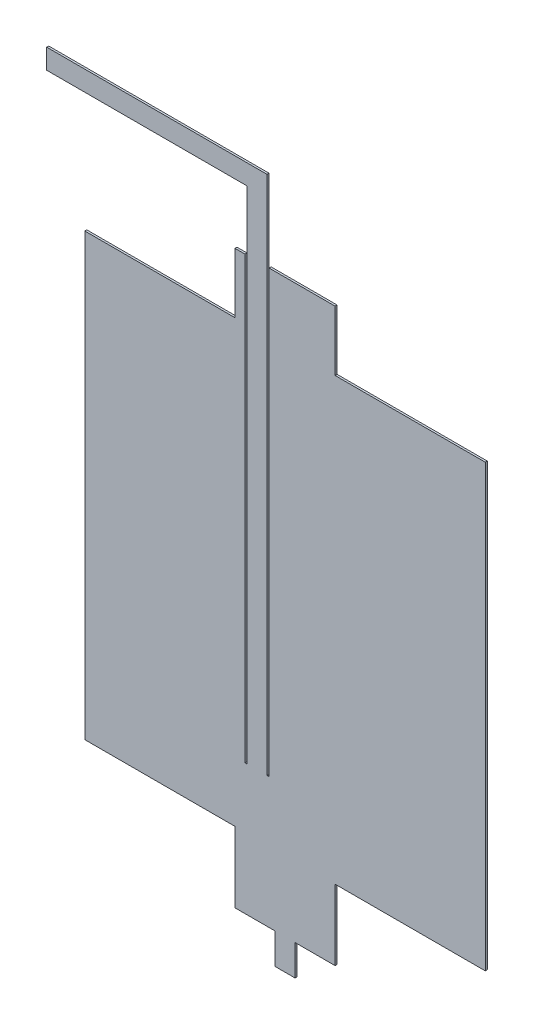
ISO-10303-21;
HEADER;
FILE_DESCRIPTION(('STEP AP214'),'2;1');
FILE_NAME('part.step','',(''),(''),'','','');
FILE_SCHEMA(('AUTOMOTIVE_DESIGN { 1 0 10303 214 1 1 1 1 }'));
ENDSEC;
DATA;
#1=APPLICATION_CONTEXT('core data for automotive mechanical design processes');
#2=APPLICATION_PROTOCOL_DEFINITION('international standard','automotive_design',2000,#1);
#3=PRODUCT_CONTEXT('',#1,'mechanical');
#4=PRODUCT('Part','Part','',(#3));
#5=PRODUCT_RELATED_PRODUCT_CATEGORY('part','',(#4));
#6=PRODUCT_DEFINITION_FORMATION('','',#4);
#7=PRODUCT_DEFINITION_CONTEXT('part definition',#1,'design');
#8=PRODUCT_DEFINITION('design','',#6,#7);
#9=PRODUCT_DEFINITION_SHAPE('','',#8);
#10=(LENGTH_UNIT() NAMED_UNIT(*) SI_UNIT(.MILLI.,.METRE.));
#11=(NAMED_UNIT(*) PLANE_ANGLE_UNIT() SI_UNIT($,.RADIAN.));
#12=(NAMED_UNIT(*) SI_UNIT($,.STERADIAN.) SOLID_ANGLE_UNIT());
#13=UNCERTAINTY_MEASURE_WITH_UNIT(LENGTH_MEASURE(1.E-05),#10,'distance_accuracy_value','');
#14=(GEOMETRIC_REPRESENTATION_CONTEXT(3) GLOBAL_UNCERTAINTY_ASSIGNED_CONTEXT((#13)) GLOBAL_UNIT_ASSIGNED_CONTEXT((#10,
#11,#12)) REPRESENTATION_CONTEXT('',''));
#15=CARTESIAN_POINT('',(0.,0.,0.));
#16=DIRECTION('',(0.,0.,1.));
#17=DIRECTION('',(1.,0.,0.));
#18=AXIS2_PLACEMENT_3D('',#15,#16,#17);
#19=CARTESIAN_POINT('',(0.,-20.,1.));
#20=DIRECTION('',(0.,1.,0.));
#21=DIRECTION('',(0.,0.,1.));
#22=AXIS2_PLACEMENT_3D('',#19,#20,#21);
#23=PLANE('',#22);
#24=DIRECTION('',(1.,0.,0.));
#25=VECTOR('',#24,1.);
#26=CARTESIAN_POINT('',(0.,-20.,0.));
#27=LINE('',#26,#25);
#28=CARTESIAN_POINT('',(0.,-20.,0.));
#29=VERTEX_POINT('',#28);
#30=CARTESIAN_POINT('',(75.,-20.,0.));
#31=VERTEX_POINT('',#30);
#32=EDGE_CURVE('E255',#29,#31,#27,.T.);
#33=ORIENTED_EDGE('',*,*,#32,.T.);
#34=DIRECTION('',(0.,0.,-1.));
#35=VECTOR('',#34,1.);
#36=CARTESIAN_POINT('',(75.,-20.,1.));
#37=LINE('',#36,#35);
#38=CARTESIAN_POINT('',(75.,-20.,1.));
#39=VERTEX_POINT('',#38);
#40=EDGE_CURVE('E54',#39,#31,#37,.T.);
#41=ORIENTED_EDGE('',*,*,#40,.F.);
#42=DIRECTION('',(1.,0.,0.));
#43=VECTOR('',#42,1.);
#44=CARTESIAN_POINT('',(0.,-20.,1.));
#45=LINE('',#44,#43);
#46=CARTESIAN_POINT('',(0.,-20.,1.));
#47=VERTEX_POINT('',#46);
#48=EDGE_CURVE('E155',#47,#39,#45,.T.);
#49=ORIENTED_EDGE('',*,*,#48,.F.);
#50=DIRECTION('',(0.,0.,-1.));
#51=VECTOR('',#50,1.);
#52=CARTESIAN_POINT('',(0.,-20.,1.));
#53=LINE('',#52,#51);
#54=EDGE_CURVE('E11',#47,#29,#53,.T.);
#55=ORIENTED_EDGE('',*,*,#54,.T.);
#56=EDGE_LOOP('',(#33,#41,#49,#55));
#57=FACE_BOUND('',#56,.T.);
#58=ADVANCED_FACE('F45',(#57),#23,.F.);
#59=CARTESIAN_POINT('',(75.,-20.,1.));
#60=DIRECTION('',(1.,0.,0.));
#61=DIRECTION('',(0.,1.,0.));
#62=AXIS2_PLACEMENT_3D('',#59,#60,#61);
#63=PLANE('',#62);
#64=DIRECTION('',(0.,-1.,0.));
#65=VECTOR('',#64,1.);
#66=CARTESIAN_POINT('',(75.,-20.,0.));
#67=LINE('',#66,#65);
#68=CARTESIAN_POINT('',(75.,-55.2329915361299,0.));
#69=VERTEX_POINT('',#68);
#70=EDGE_CURVE('E258',#31,#69,#67,.T.);
#71=ORIENTED_EDGE('',*,*,#70,.T.);
#72=DIRECTION('',(0.,0.,-1.));
#73=VECTOR('',#72,1.);
#74=CARTESIAN_POINT('',(75.,-55.2329915361299,1.));
#75=LINE('',#74,#73);
#76=CARTESIAN_POINT('',(75.,-55.2329915361299,1.));
#77=VERTEX_POINT('',#76);
#78=EDGE_CURVE('E419',#77,#69,#75,.T.);
#79=ORIENTED_EDGE('',*,*,#78,.F.);
#80=DIRECTION('',(0.,-1.,0.));
#81=VECTOR('',#80,1.);
#82=CARTESIAN_POINT('',(75.,-20.,1.));
#83=LINE('',#82,#81);
#84=EDGE_CURVE('E429',#39,#77,#83,.T.);
#85=ORIENTED_EDGE('',*,*,#84,.F.);
#86=ORIENTED_EDGE('',*,*,#40,.T.);
#87=EDGE_LOOP('',(#71,#79,#85,#86));
#88=FACE_BOUND('',#87,.T.);
#89=ADVANCED_FACE('F427',(#88),#63,.F.);
#90=CARTESIAN_POINT('',(75.,-55.2329915361299,1.));
#91=DIRECTION('',(0.,1.,0.));
#92=DIRECTION('',(0.,0.,1.));
#93=AXIS2_PLACEMENT_3D('',#90,#91,#92);
#94=PLANE('',#93);
#95=DIRECTION('',(1.,0.,0.));
#96=VECTOR('',#95,1.);
#97=CARTESIAN_POINT('',(75.,-55.2329915361299,0.));
#98=LINE('',#97,#96);
#99=CARTESIAN_POINT('',(95.,-55.2329915361299,0.));
#100=VERTEX_POINT('',#99);
#101=EDGE_CURVE('E261',#69,#100,#98,.T.);
#102=ORIENTED_EDGE('',*,*,#101,.T.);
#103=DIRECTION('',(0.,0.,-1.));
#104=VECTOR('',#103,1.);
#105=CARTESIAN_POINT('',(95.,-55.2329915361299,1.));
#106=LINE('',#105,#104);
#107=CARTESIAN_POINT('',(95.,-55.2329915361299,1.));
#108=VERTEX_POINT('',#107);
#109=EDGE_CURVE('E415',#108,#100,#106,.T.);
#110=ORIENTED_EDGE('',*,*,#109,.F.);
#111=DIRECTION('',(1.,0.,0.));
#112=VECTOR('',#111,1.);
#113=CARTESIAN_POINT('',(75.,-55.2329915361299,1.));
#114=LINE('',#113,#112);
#115=EDGE_CURVE('E448',#77,#108,#114,.T.);
#116=ORIENTED_EDGE('',*,*,#115,.F.);
#117=ORIENTED_EDGE('',*,*,#78,.T.);
#118=EDGE_LOOP('',(#102,#110,#116,#117));
#119=FACE_BOUND('',#118,.T.);
#120=ADVANCED_FACE('F438',(#119),#94,.F.);
#121=CARTESIAN_POINT('',(95.,-55.2329915361299,1.));
#122=DIRECTION('',(1.,0.,0.));
#123=DIRECTION('',(0.,1.,0.));
#124=AXIS2_PLACEMENT_3D('',#121,#122,#123);
#125=PLANE('',#124);
#126=DIRECTION('',(0.,-1.,0.));
#127=VECTOR('',#126,1.);
#128=CARTESIAN_POINT('',(95.,-55.2329915361299,0.));
#129=LINE('',#128,#127);
#130=CARTESIAN_POINT('',(95.,-70.5774369592401,0.));
#131=VERTEX_POINT('',#130);
#132=EDGE_CURVE('E264',#100,#131,#129,.T.);
#133=ORIENTED_EDGE('',*,*,#132,.T.);
#134=DIRECTION('',(0.,0.,-1.));
#135=VECTOR('',#134,1.);
#136=CARTESIAN_POINT('',(95.,-70.5774369592401,1.));
#137=LINE('',#136,#135);
#138=CARTESIAN_POINT('',(95.,-70.5774369592401,1.));
#139=VERTEX_POINT('',#138);
#140=EDGE_CURVE('E411',#139,#131,#137,.T.);
#141=ORIENTED_EDGE('',*,*,#140,.F.);
#142=DIRECTION('',(0.,-1.,0.));
#143=VECTOR('',#142,1.);
#144=CARTESIAN_POINT('',(95.,-55.2329915361299,1.));
#145=LINE('',#144,#143);
#146=EDGE_CURVE('E444',#108,#139,#145,.T.);
#147=ORIENTED_EDGE('',*,*,#146,.F.);
#148=ORIENTED_EDGE('',*,*,#109,.T.);
#149=EDGE_LOOP('',(#133,#141,#147,#148));
#150=FACE_BOUND('',#149,.T.);
#151=ADVANCED_FACE('F442',(#150),#125,.F.);
#152=CARTESIAN_POINT('',(95.,-70.5774369592401,1.));
#153=DIRECTION('',(0.,1.,0.));
#154=DIRECTION('',(0.,0.,1.));
#155=AXIS2_PLACEMENT_3D('',#152,#153,#154);
#156=PLANE('',#155);
#157=DIRECTION('',(1.,0.,0.));
#158=VECTOR('',#157,1.);
#159=CARTESIAN_POINT('',(95.,-70.5774369592401,0.));
#160=LINE('',#159,#158);
#161=CARTESIAN_POINT('',(105.,-70.5774369592401,0.));
#162=VERTEX_POINT('',#161);
#163=EDGE_CURVE('E267',#131,#162,#160,.T.);
#164=ORIENTED_EDGE('',*,*,#163,.T.);
#165=DIRECTION('',(0.,0.,-1.));
#166=VECTOR('',#165,1.);
#167=CARTESIAN_POINT('',(105.,-70.5774369592401,1.));
#168=LINE('',#167,#166);
#169=CARTESIAN_POINT('',(105.,-70.5774369592401,1.));
#170=VERTEX_POINT('',#169);
#171=EDGE_CURVE('E407',#170,#162,#168,.T.);
#172=ORIENTED_EDGE('',*,*,#171,.F.);
#173=DIRECTION('',(1.,0.,0.));
#174=VECTOR('',#173,1.);
#175=CARTESIAN_POINT('',(95.,-70.5774369592401,1.));
#176=LINE('',#175,#174);
#177=EDGE_CURVE('E447',#139,#170,#176,.T.);
#178=ORIENTED_EDGE('',*,*,#177,.F.);
#179=ORIENTED_EDGE('',*,*,#140,.T.);
#180=EDGE_LOOP('',(#164,#172,#178,#179));
#181=FACE_BOUND('',#180,.T.);
#182=ADVANCED_FACE('F534',(#181),#156,.F.);
#183=CARTESIAN_POINT('',(105.,-70.5774369592401,1.));
#184=DIRECTION('',(-1.,0.,0.));
#185=DIRECTION('',(0.,0.,1.));
#186=AXIS2_PLACEMENT_3D('',#183,#184,#185);
#187=PLANE('',#186);
#188=DIRECTION('',(0.,1.,0.));
#189=VECTOR('',#188,1.);
#190=CARTESIAN_POINT('',(105.,-70.5774369592401,0.));
#191=LINE('',#190,#189);
#192=CARTESIAN_POINT('',(105.,-55.2329915361299,0.));
#193=VERTEX_POINT('',#192);
#194=EDGE_CURVE('E270',#162,#193,#191,.T.);
#195=ORIENTED_EDGE('',*,*,#194,.T.);
#196=DIRECTION('',(0.,0.,-1.));
#197=VECTOR('',#196,1.);
#198=CARTESIAN_POINT('',(105.,-55.2329915361299,1.));
#199=LINE('',#198,#197);
#200=CARTESIAN_POINT('',(105.,-55.2329915361299,1.));
#201=VERTEX_POINT('',#200);
#202=EDGE_CURVE('E403',#201,#193,#199,.T.);
#203=ORIENTED_EDGE('',*,*,#202,.F.);
#204=DIRECTION('',(0.,1.,0.));
#205=VECTOR('',#204,1.);
#206=CARTESIAN_POINT('',(105.,-70.5774369592401,1.));
#207=LINE('',#206,#205);
#208=EDGE_CURVE('E452',#170,#201,#207,.T.);
#209=ORIENTED_EDGE('',*,*,#208,.F.);
#210=ORIENTED_EDGE('',*,*,#171,.T.);
#211=EDGE_LOOP('',(#195,#203,#209,#210));
#212=FACE_BOUND('',#211,.T.);
#213=ADVANCED_FACE('F537',(#212),#187,.F.);
#214=CARTESIAN_POINT('',(105.,-55.2329915361299,1.));
#215=DIRECTION('',(0.,1.,0.));
#216=DIRECTION('',(0.,0.,1.));
#217=AXIS2_PLACEMENT_3D('',#214,#215,#216);
#218=PLANE('',#217);
#219=DIRECTION('',(1.,0.,0.));
#220=VECTOR('',#219,1.);
#221=CARTESIAN_POINT('',(105.,-55.2329915361299,0.));
#222=LINE('',#221,#220);
#223=CARTESIAN_POINT('',(125.,-55.2329915361299,0.));
#224=VERTEX_POINT('',#223);
#225=EDGE_CURVE('E273',#193,#224,#222,.T.);
#226=ORIENTED_EDGE('',*,*,#225,.T.);
#227=DIRECTION('',(0.,0.,-1.));
#228=VECTOR('',#227,1.);
#229=CARTESIAN_POINT('',(125.,-55.2329915361299,1.));
#230=LINE('',#229,#228);
#231=CARTESIAN_POINT('',(125.,-55.2329915361299,1.));
#232=VERTEX_POINT('',#231);
#233=EDGE_CURVE('E399',#232,#224,#230,.T.);
#234=ORIENTED_EDGE('',*,*,#233,.F.);
#235=DIRECTION('',(1.,0.,0.));
#236=VECTOR('',#235,1.);
#237=CARTESIAN_POINT('',(105.,-55.2329915361299,1.));
#238=LINE('',#237,#236);
#239=EDGE_CURVE('E459',#201,#232,#238,.T.);
#240=ORIENTED_EDGE('',*,*,#239,.F.);
#241=ORIENTED_EDGE('',*,*,#202,.T.);
#242=EDGE_LOOP('',(#226,#234,#240,#241));
#243=FACE_BOUND('',#242,.T.);
#244=ADVANCED_FACE('F541',(#243),#218,.F.);
#245=CARTESIAN_POINT('',(125.,-55.2329915361299,1.));
#246=DIRECTION('',(-1.,0.,0.));
#247=DIRECTION('',(0.,0.,1.));
#248=AXIS2_PLACEMENT_3D('',#245,#246,#247);
#249=PLANE('',#248);
#250=DIRECTION('',(0.,1.,0.));
#251=VECTOR('',#250,1.);
#252=CARTESIAN_POINT('',(125.,-55.2329915361299,0.));
#253=LINE('',#252,#251);
#254=CARTESIAN_POINT('',(125.,-20.,0.));
#255=VERTEX_POINT('',#254);
#256=EDGE_CURVE('E276',#224,#255,#253,.T.);
#257=ORIENTED_EDGE('',*,*,#256,.T.);
#258=DIRECTION('',(0.,0.,-1.));
#259=VECTOR('',#258,1.);
#260=CARTESIAN_POINT('',(125.,-20.,1.));
#261=LINE('',#260,#259);
#262=CARTESIAN_POINT('',(125.,-20.,1.));
#263=VERTEX_POINT('',#262);
#264=EDGE_CURVE('E395',#263,#255,#261,.T.);
#265=ORIENTED_EDGE('',*,*,#264,.F.);
#266=DIRECTION('',(0.,1.,0.));
#267=VECTOR('',#266,1.);
#268=CARTESIAN_POINT('',(125.,-55.2329915361299,1.));
#269=LINE('',#268,#267);
#270=EDGE_CURVE('E462',#232,#263,#269,.T.);
#271=ORIENTED_EDGE('',*,*,#270,.F.);
#272=ORIENTED_EDGE('',*,*,#233,.T.);
#273=EDGE_LOOP('',(#257,#265,#271,#272));
#274=FACE_BOUND('',#273,.T.);
#275=ADVANCED_FACE('F545',(#274),#249,.F.);
#276=CARTESIAN_POINT('',(125.,-20.,1.));
#277=DIRECTION('',(0.,1.,0.));
#278=DIRECTION('',(0.,0.,1.));
#279=AXIS2_PLACEMENT_3D('',#276,#277,#278);
#280=PLANE('',#279);
#281=DIRECTION('',(1.,0.,0.));
#282=VECTOR('',#281,1.);
#283=CARTESIAN_POINT('',(125.,-20.,0.));
#284=LINE('',#283,#282);
#285=CARTESIAN_POINT('',(200.,-20.,0.));
#286=VERTEX_POINT('',#285);
#287=EDGE_CURVE('E279',#255,#286,#284,.T.);
#288=ORIENTED_EDGE('',*,*,#287,.T.);
#289=DIRECTION('',(0.,0.,-1.));
#290=VECTOR('',#289,1.);
#291=CARTESIAN_POINT('',(200.,-20.,1.));
#292=LINE('',#291,#290);
#293=CARTESIAN_POINT('',(200.,-20.,1.));
#294=VERTEX_POINT('',#293);
#295=EDGE_CURVE('E391',#294,#286,#292,.T.);
#296=ORIENTED_EDGE('',*,*,#295,.F.);
#297=DIRECTION('',(1.,0.,0.));
#298=VECTOR('',#297,1.);
#299=CARTESIAN_POINT('',(125.,-20.,1.));
#300=LINE('',#299,#298);
#301=EDGE_CURVE('E465',#263,#294,#300,.T.);
#302=ORIENTED_EDGE('',*,*,#301,.F.);
#303=ORIENTED_EDGE('',*,*,#264,.T.);
#304=EDGE_LOOP('',(#288,#296,#302,#303));
#305=FACE_BOUND('',#304,.T.);
#306=ADVANCED_FACE('F549',(#305),#280,.F.);
#307=CARTESIAN_POINT('',(200.,0.,1.));
#308=DIRECTION('',(-1.,0.,0.));
#309=DIRECTION('',(0.,0.,1.));
#310=AXIS2_PLACEMENT_3D('',#307,#308,#309);
#311=PLANE('',#310);
#312=DIRECTION('',(0.,1.,0.));
#313=VECTOR('',#312,1.);
#314=CARTESIAN_POINT('',(200.,0.,0.));
#315=LINE('',#314,#313);
#316=CARTESIAN_POINT('',(200.,200.,0.));
#317=VERTEX_POINT('',#316);
#318=EDGE_CURVE('E283',#286,#317,#315,.T.);
#319=ORIENTED_EDGE('',*,*,#318,.T.);
#320=DIRECTION('',(0.,0.,-1.));
#321=VECTOR('',#320,1.);
#322=CARTESIAN_POINT('',(200.,200.,1.));
#323=LINE('',#322,#321);
#324=CARTESIAN_POINT('',(200.,200.,1.));
#325=VERTEX_POINT('',#324);
#326=EDGE_CURVE('E388',#325,#317,#323,.T.);
#327=ORIENTED_EDGE('',*,*,#326,.F.);
#328=DIRECTION('',(0.,-1.,0.));
#329=VECTOR('',#328,1.);
#330=CARTESIAN_POINT('',(200.,0.,1.));
#331=LINE('',#330,#329);
#332=EDGE_CURVE('E468',#325,#294,#331,.T.);
#333=ORIENTED_EDGE('',*,*,#332,.T.);
#334=ORIENTED_EDGE('',*,*,#295,.T.);
#335=EDGE_LOOP('',(#319,#327,#333,#334));
#336=FACE_BOUND('',#335,.T.);
#337=ADVANCED_FACE('F553',(#336),#311,.F.);
#338=CARTESIAN_POINT('',(125.,200.,1.));
#339=DIRECTION('',(0.,1.,0.));
#340=DIRECTION('',(0.,0.,1.));
#341=AXIS2_PLACEMENT_3D('',#338,#339,#340);
#342=PLANE('',#341);
#343=DIRECTION('',(1.,0.,0.));
#344=VECTOR('',#343,1.);
#345=CARTESIAN_POINT('',(125.,200.,0.));
#346=LINE('',#345,#344);
#347=CARTESIAN_POINT('',(125.,200.,0.));
#348=VERTEX_POINT('',#347);
#349=EDGE_CURVE('E287',#348,#317,#346,.T.);
#350=ORIENTED_EDGE('',*,*,#349,.F.);
#351=DIRECTION('',(0.,0.,-1.));
#352=VECTOR('',#351,1.);
#353=CARTESIAN_POINT('',(125.,200.,1.));
#354=LINE('',#353,#352);
#355=CARTESIAN_POINT('',(125.,200.,1.));
#356=VERTEX_POINT('',#355);
#357=EDGE_CURVE('E385',#356,#348,#354,.T.);
#358=ORIENTED_EDGE('',*,*,#357,.F.);
#359=DIRECTION('',(1.,0.,0.));
#360=VECTOR('',#359,1.);
#361=CARTESIAN_POINT('',(125.,200.,1.));
#362=LINE('',#361,#360);
#363=EDGE_CURVE('E472',#356,#325,#362,.T.);
#364=ORIENTED_EDGE('',*,*,#363,.T.);
#365=ORIENTED_EDGE('',*,*,#326,.T.);
#366=EDGE_LOOP('',(#350,#358,#364,#365));
#367=FACE_BOUND('',#366,.T.);
#368=ADVANCED_FACE('F557',(#367),#342,.T.);
#369=CARTESIAN_POINT('',(125.,230.,1.));
#370=DIRECTION('',(1.,0.,0.));
#371=DIRECTION('',(0.,0.,-1.));
#372=AXIS2_PLACEMENT_3D('',#369,#370,#371);
#373=PLANE('',#372);
#374=DIRECTION('',(0.,-1.,0.));
#375=VECTOR('',#374,1.);
#376=CARTESIAN_POINT('',(125.,230.,0.));
#377=LINE('',#376,#375);
#378=CARTESIAN_POINT('',(125.,230.,0.));
#379=VERTEX_POINT('',#378);
#380=EDGE_CURVE('E291',#379,#348,#377,.T.);
#381=ORIENTED_EDGE('',*,*,#380,.F.);
#382=DIRECTION('',(0.,0.,-1.));
#383=VECTOR('',#382,1.);
#384=CARTESIAN_POINT('',(125.,230.,1.));
#385=LINE('',#384,#383);
#386=CARTESIAN_POINT('',(125.,230.,1.));
#387=VERTEX_POINT('',#386);
#388=EDGE_CURVE('E382',#387,#379,#385,.T.);
#389=ORIENTED_EDGE('',*,*,#388,.F.);
#390=DIRECTION('',(0.,-1.,0.));
#391=VECTOR('',#390,1.);
#392=CARTESIAN_POINT('',(125.,230.,1.));
#393=LINE('',#392,#391);
#394=EDGE_CURVE('E476',#387,#356,#393,.T.);
#395=ORIENTED_EDGE('',*,*,#394,.T.);
#396=ORIENTED_EDGE('',*,*,#357,.T.);
#397=EDGE_LOOP('',(#381,#389,#395,#396));
#398=FACE_BOUND('',#397,.T.);
#399=ADVANCED_FACE('F561',(#398),#373,.T.);
#400=CARTESIAN_POINT('',(92.,230.,1.));
#401=DIRECTION('',(0.,1.,0.));
#402=DIRECTION('',(0.,0.,1.));
#403=AXIS2_PLACEMENT_3D('',#400,#401,#402);
#404=PLANE('',#403);
#405=DIRECTION('',(1.,0.,0.));
#406=VECTOR('',#405,1.);
#407=CARTESIAN_POINT('',(92.,230.,0.));
#408=LINE('',#407,#406);
#409=CARTESIAN_POINT('',(92.,230.,0.));
#410=VERTEX_POINT('',#409);
#411=EDGE_CURVE('E295',#410,#379,#408,.T.);
#412=ORIENTED_EDGE('',*,*,#411,.F.);
#413=DIRECTION('',(0.,0.,-1.));
#414=VECTOR('',#413,1.);
#415=CARTESIAN_POINT('',(92.,230.,1.));
#416=LINE('',#415,#414);
#417=CARTESIAN_POINT('',(92.,230.,1.));
#418=VERTEX_POINT('',#417);
#419=EDGE_CURVE('E379',#418,#410,#416,.T.);
#420=ORIENTED_EDGE('',*,*,#419,.F.);
#421=DIRECTION('',(1.,0.,0.));
#422=VECTOR('',#421,1.);
#423=CARTESIAN_POINT('',(92.,230.,1.));
#424=LINE('',#423,#422);
#425=EDGE_CURVE('E480',#418,#387,#424,.T.);
#426=ORIENTED_EDGE('',*,*,#425,.T.);
#427=ORIENTED_EDGE('',*,*,#388,.T.);
#428=EDGE_LOOP('',(#412,#420,#426,#427));
#429=FACE_BOUND('',#428,.T.);
#430=ADVANCED_FACE('F565',(#429),#404,.T.);
#431=CARTESIAN_POINT('',(92.,10.,1.));
#432=DIRECTION('',(-1.,0.,0.));
#433=DIRECTION('',(0.,0.,1.));
#434=AXIS2_PLACEMENT_3D('',#431,#432,#433);
#435=PLANE('',#434);
#436=DIRECTION('',(0.,1.,0.));
#437=VECTOR('',#436,1.);
#438=CARTESIAN_POINT('',(92.,10.,0.));
#439=LINE('',#438,#437);
#440=CARTESIAN_POINT('',(92.,10.,0.));
#441=VERTEX_POINT('',#440);
#442=EDGE_CURVE('E299',#441,#410,#439,.T.);
#443=ORIENTED_EDGE('',*,*,#442,.F.);
#444=DIRECTION('',(0.,0.,-1.));
#445=VECTOR('',#444,1.);
#446=CARTESIAN_POINT('',(92.,10.,1.));
#447=LINE('',#446,#445);
#448=CARTESIAN_POINT('',(92.,10.,1.));
#449=VERTEX_POINT('',#448);
#450=EDGE_CURVE('E376',#449,#441,#447,.T.);
#451=ORIENTED_EDGE('',*,*,#450,.F.);
#452=DIRECTION('',(0.,1.,0.));
#453=VECTOR('',#452,1.);
#454=CARTESIAN_POINT('',(92.,10.,1.));
#455=LINE('',#454,#453);
#456=EDGE_CURVE('E484',#449,#418,#455,.T.);
#457=ORIENTED_EDGE('',*,*,#456,.T.);
#458=ORIENTED_EDGE('',*,*,#419,.T.);
#459=EDGE_LOOP('',(#443,#451,#457,#458));
#460=FACE_BOUND('',#459,.T.);
#461=ADVANCED_FACE('F569',(#460),#435,.T.);
#462=CARTESIAN_POINT('',(91.,10.,1.));
#463=DIRECTION('',(0.,1.,0.));
#464=DIRECTION('',(0.,0.,1.));
#465=AXIS2_PLACEMENT_3D('',#462,#463,#464);
#466=PLANE('',#465);
#467=DIRECTION('',(1.,0.,0.));
#468=VECTOR('',#467,1.);
#469=CARTESIAN_POINT('',(91.,10.,0.));
#470=LINE('',#469,#468);
#471=CARTESIAN_POINT('',(91.,10.,0.));
#472=VERTEX_POINT('',#471);
#473=EDGE_CURVE('E303',#472,#441,#470,.T.);
#474=ORIENTED_EDGE('',*,*,#473,.F.);
#475=DIRECTION('',(0.,0.,-1.));
#476=VECTOR('',#475,1.);
#477=CARTESIAN_POINT('',(91.,10.,1.));
#478=LINE('',#477,#476);
#479=CARTESIAN_POINT('',(91.,10.,1.));
#480=VERTEX_POINT('',#479);
#481=EDGE_CURVE('E372',#480,#472,#478,.T.);
#482=ORIENTED_EDGE('',*,*,#481,.F.);
#483=DIRECTION('',(1.,0.,0.));
#484=VECTOR('',#483,1.);
#485=CARTESIAN_POINT('',(91.,10.,1.));
#486=LINE('',#485,#484);
#487=EDGE_CURVE('E488',#480,#449,#486,.T.);
#488=ORIENTED_EDGE('',*,*,#487,.T.);
#489=ORIENTED_EDGE('',*,*,#450,.T.);
#490=EDGE_LOOP('',(#474,#482,#488,#489));
#491=FACE_BOUND('',#490,.T.);
#492=ADVANCED_FACE('F573',(#491),#466,.T.);
#493=CARTESIAN_POINT('',(91.,270.,1.));
#494=DIRECTION('',(1.,0.,0.));
#495=DIRECTION('',(0.,0.,-1.));
#496=AXIS2_PLACEMENT_3D('',#493,#494,#495);
#497=PLANE('',#496);
#498=DIRECTION('',(0.,-1.,0.));
#499=VECTOR('',#498,1.);
#500=CARTESIAN_POINT('',(91.,270.,0.));
#501=LINE('',#500,#499);
#502=CARTESIAN_POINT('',(91.,270.,0.));
#503=VERTEX_POINT('',#502);
#504=EDGE_CURVE('E307',#503,#472,#501,.T.);
#505=ORIENTED_EDGE('',*,*,#504,.F.);
#506=DIRECTION('',(0.,0.,-1.));
#507=VECTOR('',#506,1.);
#508=CARTESIAN_POINT('',(91.,270.,1.));
#509=LINE('',#508,#507);
#510=CARTESIAN_POINT('',(91.,270.,1.));
#511=VERTEX_POINT('',#510);
#512=EDGE_CURVE('E369',#511,#503,#509,.T.);
#513=ORIENTED_EDGE('',*,*,#512,.F.);
#514=DIRECTION('',(0.,1.,0.));
#515=VECTOR('',#514,1.);
#516=CARTESIAN_POINT('',(91.,10.,1.));
#517=LINE('',#516,#515);
#518=EDGE_CURVE('E492',#480,#511,#517,.T.);
#519=ORIENTED_EDGE('',*,*,#518,.F.);
#520=ORIENTED_EDGE('',*,*,#481,.T.);
#521=EDGE_LOOP('',(#505,#513,#519,#520));
#522=FACE_BOUND('',#521,.T.);
#523=ADVANCED_FACE('F577',(#522),#497,.T.);
#524=CARTESIAN_POINT('',(-19.,270.,1.));
#525=DIRECTION('',(0.,1.,0.));
#526=DIRECTION('',(0.,0.,1.));
#527=AXIS2_PLACEMENT_3D('',#524,#525,#526);
#528=PLANE('',#527);
#529=DIRECTION('',(1.,0.,0.));
#530=VECTOR('',#529,1.);
#531=CARTESIAN_POINT('',(-19.,270.,0.));
#532=LINE('',#531,#530);
#533=CARTESIAN_POINT('',(-19.,270.,0.));
#534=VERTEX_POINT('',#533);
#535=EDGE_CURVE('E310',#534,#503,#532,.T.);
#536=ORIENTED_EDGE('',*,*,#535,.F.);
#537=DIRECTION('',(0.,0.,-1.));
#538=VECTOR('',#537,1.);
#539=CARTESIAN_POINT('',(-19.,270.,1.));
#540=LINE('',#539,#538);
#541=CARTESIAN_POINT('',(-19.,270.,1.));
#542=VERTEX_POINT('',#541);
#543=EDGE_CURVE('E366',#542,#534,#540,.T.);
#544=ORIENTED_EDGE('',*,*,#543,.F.);
#545=DIRECTION('',(1.,0.,0.));
#546=VECTOR('',#545,1.);
#547=CARTESIAN_POINT('',(-19.,270.,1.));
#548=LINE('',#547,#546);
#549=EDGE_CURVE('E495',#542,#511,#548,.T.);
#550=ORIENTED_EDGE('',*,*,#549,.T.);
#551=ORIENTED_EDGE('',*,*,#512,.T.);
#552=EDGE_LOOP('',(#536,#544,#550,#551));
#553=FACE_BOUND('',#552,.T.);
#554=ADVANCED_FACE('F581',(#553),#528,.T.);
#555=CARTESIAN_POINT('',(-19.,260.,1.));
#556=DIRECTION('',(-1.,0.,0.));
#557=DIRECTION('',(0.,0.,1.));
#558=AXIS2_PLACEMENT_3D('',#555,#556,#557);
#559=PLANE('',#558);
#560=DIRECTION('',(0.,1.,0.));
#561=VECTOR('',#560,1.);
#562=CARTESIAN_POINT('',(-19.,260.,0.));
#563=LINE('',#562,#561);
#564=CARTESIAN_POINT('',(-19.,260.,0.));
#565=VERTEX_POINT('',#564);
#566=EDGE_CURVE('E314',#565,#534,#563,.T.);
#567=ORIENTED_EDGE('',*,*,#566,.F.);
#568=DIRECTION('',(0.,0.,-1.));
#569=VECTOR('',#568,1.);
#570=CARTESIAN_POINT('',(-19.,260.,1.));
#571=LINE('',#570,#569);
#572=CARTESIAN_POINT('',(-19.,260.,1.));
#573=VERTEX_POINT('',#572);
#574=EDGE_CURVE('E363',#573,#565,#571,.T.);
#575=ORIENTED_EDGE('',*,*,#574,.F.);
#576=DIRECTION('',(0.,1.,0.));
#577=VECTOR('',#576,1.);
#578=CARTESIAN_POINT('',(-19.,260.,1.));
#579=LINE('',#578,#577);
#580=EDGE_CURVE('E499',#573,#542,#579,.T.);
#581=ORIENTED_EDGE('',*,*,#580,.T.);
#582=ORIENTED_EDGE('',*,*,#543,.T.);
#583=EDGE_LOOP('',(#567,#575,#581,#582));
#584=FACE_BOUND('',#583,.T.);
#585=ADVANCED_FACE('F585',(#584),#559,.T.);
#586=CARTESIAN_POINT('',(81.,260.,1.));
#587=DIRECTION('',(0.,-1.,0.));
#588=DIRECTION('',(0.,0.,-1.));
#589=AXIS2_PLACEMENT_3D('',#586,#587,#588);
#590=PLANE('',#589);
#591=DIRECTION('',(-1.,0.,0.));
#592=VECTOR('',#591,1.);
#593=CARTESIAN_POINT('',(81.,260.,0.));
#594=LINE('',#593,#592);
#595=CARTESIAN_POINT('',(81.,260.,0.));
#596=VERTEX_POINT('',#595);
#597=EDGE_CURVE('E318',#596,#565,#594,.T.);
#598=ORIENTED_EDGE('',*,*,#597,.F.);
#599=DIRECTION('',(0.,0.,-1.));
#600=VECTOR('',#599,1.);
#601=CARTESIAN_POINT('',(81.,260.,1.));
#602=LINE('',#601,#600);
#603=CARTESIAN_POINT('',(81.,260.,1.));
#604=VERTEX_POINT('',#603);
#605=EDGE_CURVE('E359',#604,#596,#602,.T.);
#606=ORIENTED_EDGE('',*,*,#605,.F.);
#607=DIRECTION('',(-1.,0.,0.));
#608=VECTOR('',#607,1.);
#609=CARTESIAN_POINT('',(81.,260.,1.));
#610=LINE('',#609,#608);
#611=EDGE_CURVE('E503',#604,#573,#610,.T.);
#612=ORIENTED_EDGE('',*,*,#611,.T.);
#613=ORIENTED_EDGE('',*,*,#574,.T.);
#614=EDGE_LOOP('',(#598,#606,#612,#613));
#615=FACE_BOUND('',#614,.T.);
#616=ADVANCED_FACE('F589',(#615),#590,.T.);
#617=CARTESIAN_POINT('',(81.,230.,1.));
#618=DIRECTION('',(1.,0.,0.));
#619=DIRECTION('',(0.,1.,0.));
#620=AXIS2_PLACEMENT_3D('',#617,#618,#619);
#621=PLANE('',#620);
#622=DIRECTION('',(0.,-1.,0.));
#623=VECTOR('',#622,1.);
#624=CARTESIAN_POINT('',(81.,230.,0.));
#625=LINE('',#624,#623);
#626=CARTESIAN_POINT('',(81.,10.,0.));
#627=VERTEX_POINT('',#626);
#628=EDGE_CURVE('E322',#596,#627,#625,.T.);
#629=ORIENTED_EDGE('',*,*,#628,.T.);
#630=DIRECTION('',(0.,0.,-1.));
#631=VECTOR('',#630,1.);
#632=CARTESIAN_POINT('',(81.,10.,1.));
#633=LINE('',#632,#631);
#634=CARTESIAN_POINT('',(81.,10.,1.));
#635=VERTEX_POINT('',#634);
#636=EDGE_CURVE('E356',#635,#627,#633,.T.);
#637=ORIENTED_EDGE('',*,*,#636,.F.);
#638=DIRECTION('',(0.,1.,0.));
#639=VECTOR('',#638,1.);
#640=CARTESIAN_POINT('',(81.,230.,1.));
#641=LINE('',#640,#639);
#642=EDGE_CURVE('E507',#635,#604,#641,.T.);
#643=ORIENTED_EDGE('',*,*,#642,.T.);
#644=ORIENTED_EDGE('',*,*,#605,.T.);
#645=EDGE_LOOP('',(#629,#637,#643,#644));
#646=FACE_BOUND('',#645,.T.);
#647=ADVANCED_FACE('F593',(#646),#621,.F.);
#648=CARTESIAN_POINT('',(80.,10.,1.));
#649=DIRECTION('',(0.,1.,0.));
#650=DIRECTION('',(0.,0.,1.));
#651=AXIS2_PLACEMENT_3D('',#648,#649,#650);
#652=PLANE('',#651);
#653=DIRECTION('',(1.,0.,0.));
#654=VECTOR('',#653,1.);
#655=CARTESIAN_POINT('',(80.,10.,0.));
#656=LINE('',#655,#654);
#657=CARTESIAN_POINT('',(80.,10.,0.));
#658=VERTEX_POINT('',#657);
#659=EDGE_CURVE('E326',#658,#627,#656,.T.);
#660=ORIENTED_EDGE('',*,*,#659,.F.);
#661=DIRECTION('',(0.,0.,-1.));
#662=VECTOR('',#661,1.);
#663=CARTESIAN_POINT('',(80.,10.,1.));
#664=LINE('',#663,#662);
#665=CARTESIAN_POINT('',(80.,10.,1.));
#666=VERTEX_POINT('',#665);
#667=EDGE_CURVE('E353',#666,#658,#664,.T.);
#668=ORIENTED_EDGE('',*,*,#667,.F.);
#669=DIRECTION('',(1.,0.,0.));
#670=VECTOR('',#669,1.);
#671=CARTESIAN_POINT('',(80.,10.,1.));
#672=LINE('',#671,#670);
#673=EDGE_CURVE('E511',#666,#635,#672,.T.);
#674=ORIENTED_EDGE('',*,*,#673,.T.);
#675=ORIENTED_EDGE('',*,*,#636,.T.);
#676=EDGE_LOOP('',(#660,#668,#674,#675));
#677=FACE_BOUND('',#676,.T.);
#678=ADVANCED_FACE('F597',(#677),#652,.T.);
#679=CARTESIAN_POINT('',(80.,230.,1.));
#680=DIRECTION('',(1.,0.,0.));
#681=DIRECTION('',(0.,0.,-1.));
#682=AXIS2_PLACEMENT_3D('',#679,#680,#681);
#683=PLANE('',#682);
#684=DIRECTION('',(0.,-1.,0.));
#685=VECTOR('',#684,1.);
#686=CARTESIAN_POINT('',(80.,230.,0.));
#687=LINE('',#686,#685);
#688=CARTESIAN_POINT('',(80.,230.,0.));
#689=VERTEX_POINT('',#688);
#690=EDGE_CURVE('E330',#689,#658,#687,.T.);
#691=ORIENTED_EDGE('',*,*,#690,.F.);
#692=DIRECTION('',(0.,0.,-1.));
#693=VECTOR('',#692,1.);
#694=CARTESIAN_POINT('',(80.,230.,1.));
#695=LINE('',#694,#693);
#696=CARTESIAN_POINT('',(80.,230.,1.));
#697=VERTEX_POINT('',#696);
#698=EDGE_CURVE('E234',#697,#689,#695,.T.);
#699=ORIENTED_EDGE('',*,*,#698,.F.);
#700=DIRECTION('',(0.,-1.,0.));
#701=VECTOR('',#700,1.);
#702=CARTESIAN_POINT('',(80.,230.,1.));
#703=LINE('',#702,#701);
#704=EDGE_CURVE('E244',#697,#666,#703,.T.);
#705=ORIENTED_EDGE('',*,*,#704,.T.);
#706=ORIENTED_EDGE('',*,*,#667,.T.);
#707=EDGE_LOOP('',(#691,#699,#705,#706));
#708=FACE_BOUND('',#707,.T.);
#709=ADVANCED_FACE('F517',(#708),#683,.T.);
#710=CARTESIAN_POINT('',(75.,230.,1.));
#711=DIRECTION('',(0.,1.,0.));
#712=DIRECTION('',(0.,0.,1.));
#713=AXIS2_PLACEMENT_3D('',#710,#711,#712);
#714=PLANE('',#713);
#715=DIRECTION('',(1.,0.,0.));
#716=VECTOR('',#715,1.);
#717=CARTESIAN_POINT('',(75.,230.,0.));
#718=LINE('',#717,#716);
#719=CARTESIAN_POINT('',(75.,230.,0.));
#720=VERTEX_POINT('',#719);
#721=EDGE_CURVE('E229',#720,#689,#718,.T.);
#722=ORIENTED_EDGE('',*,*,#721,.F.);
#723=DIRECTION('',(0.,0.,-1.));
#724=VECTOR('',#723,1.);
#725=CARTESIAN_POINT('',(75.,230.,1.));
#726=LINE('',#725,#724);
#727=CARTESIAN_POINT('',(75.,230.,1.));
#728=VERTEX_POINT('',#727);
#729=EDGE_CURVE('E224',#728,#720,#726,.T.);
#730=ORIENTED_EDGE('',*,*,#729,.F.);
#731=DIRECTION('',(1.,0.,0.));
#732=VECTOR('',#731,1.);
#733=CARTESIAN_POINT('',(75.,230.,1.));
#734=LINE('',#733,#732);
#735=EDGE_CURVE('E227',#728,#697,#734,.T.);
#736=ORIENTED_EDGE('',*,*,#735,.T.);
#737=ORIENTED_EDGE('',*,*,#698,.T.);
#738=EDGE_LOOP('',(#722,#730,#736,#737));
#739=FACE_BOUND('',#738,.T.);
#740=ADVANCED_FACE('F226',(#739),#714,.T.);
#741=CARTESIAN_POINT('',(75.,200.,1.));
#742=DIRECTION('',(-1.,0.,0.));
#743=DIRECTION('',(0.,-1.,0.));
#744=AXIS2_PLACEMENT_3D('',#741,#742,#743);
#745=PLANE('',#744);
#746=DIRECTION('',(0.,1.,0.));
#747=VECTOR('',#746,1.);
#748=CARTESIAN_POINT('',(75.,200.,0.));
#749=LINE('',#748,#747);
#750=CARTESIAN_POINT('',(75.,200.,0.));
#751=VERTEX_POINT('',#750);
#752=EDGE_CURVE('E336',#751,#720,#749,.T.);
#753=ORIENTED_EDGE('',*,*,#752,.F.);
#754=DIRECTION('',(0.,0.,-1.));
#755=VECTOR('',#754,1.);
#756=CARTESIAN_POINT('',(75.,200.,1.));
#757=LINE('',#756,#755);
#758=CARTESIAN_POINT('',(75.,200.,1.));
#759=VERTEX_POINT('',#758);
#760=EDGE_CURVE('E145',#759,#751,#757,.T.);
#761=ORIENTED_EDGE('',*,*,#760,.F.);
#762=DIRECTION('',(0.,1.,0.));
#763=VECTOR('',#762,1.);
#764=CARTESIAN_POINT('',(75.,200.,1.));
#765=LINE('',#764,#763);
#766=EDGE_CURVE('E241',#759,#728,#765,.T.);
#767=ORIENTED_EDGE('',*,*,#766,.T.);
#768=ORIENTED_EDGE('',*,*,#729,.T.);
#769=EDGE_LOOP('',(#753,#761,#767,#768));
#770=FACE_BOUND('',#769,.T.);
#771=ADVANCED_FACE('F247',(#770),#745,.T.);
#772=CARTESIAN_POINT('',(0.,200.,1.));
#773=DIRECTION('',(0.,1.,0.));
#774=DIRECTION('',(0.,0.,1.));
#775=AXIS2_PLACEMENT_3D('',#772,#773,#774);
#776=PLANE('',#775);
#777=DIRECTION('',(1.,0.,0.));
#778=VECTOR('',#777,1.);
#779=CARTESIAN_POINT('',(0.,200.,0.));
#780=LINE('',#779,#778);
#781=CARTESIAN_POINT('',(0.,200.,0.));
#782=VERTEX_POINT('',#781);
#783=EDGE_CURVE('E339',#782,#751,#780,.T.);
#784=ORIENTED_EDGE('',*,*,#783,.F.);
#785=DIRECTION('',(0.,0.,-1.));
#786=VECTOR('',#785,1.);
#787=CARTESIAN_POINT('',(0.,200.,1.));
#788=LINE('',#787,#786);
#789=CARTESIAN_POINT('',(0.,200.,1.));
#790=VERTEX_POINT('',#789);
#791=EDGE_CURVE('E148',#790,#782,#788,.T.);
#792=ORIENTED_EDGE('',*,*,#791,.F.);
#793=DIRECTION('',(1.,0.,0.));
#794=VECTOR('',#793,1.);
#795=CARTESIAN_POINT('',(0.,200.,1.));
#796=LINE('',#795,#794);
#797=EDGE_CURVE('E249',#790,#759,#796,.T.);
#798=ORIENTED_EDGE('',*,*,#797,.T.);
#799=ORIENTED_EDGE('',*,*,#760,.T.);
#800=EDGE_LOOP('',(#784,#792,#798,#799));
#801=FACE_BOUND('',#800,.T.);
#802=ADVANCED_FACE('F519',(#801),#776,.T.);
#803=CARTESIAN_POINT('',(0.,0.,1.));
#804=DIRECTION('',(-1.,0.,0.));
#805=DIRECTION('',(0.,0.,1.));
#806=AXIS2_PLACEMENT_3D('',#803,#804,#805);
#807=PLANE('',#806);
#808=DIRECTION('',(0.,1.,0.));
#809=VECTOR('',#808,1.);
#810=CARTESIAN_POINT('',(0.,0.,0.));
#811=LINE('',#810,#809);
#812=EDGE_CURVE('E343',#29,#782,#811,.T.);
#813=ORIENTED_EDGE('',*,*,#812,.F.);
#814=ORIENTED_EDGE('',*,*,#54,.F.);
#815=DIRECTION('',(0.,-1.,0.));
#816=VECTOR('',#815,1.);
#817=CARTESIAN_POINT('',(0.,0.,1.));
#818=LINE('',#817,#816);
#819=EDGE_CURVE('E62',#790,#47,#818,.T.);
#820=ORIENTED_EDGE('',*,*,#819,.F.);
#821=ORIENTED_EDGE('',*,*,#791,.T.);
#822=EDGE_LOOP('',(#813,#814,#820,#821));
#823=FACE_BOUND('',#822,.T.);
#824=ADVANCED_FACE('F522',(#823),#807,.T.);
#825=CARTESIAN_POINT('',(0.,0.,1.));
#826=DIRECTION('',(0.,0.,1.));
#827=DIRECTION('',(1.,0.,0.));
#828=AXIS2_PLACEMENT_3D('',#825,#826,#827);
#829=PLANE('',#828);
#830=ORIENTED_EDGE('',*,*,#819,.T.);
#831=ORIENTED_EDGE('',*,*,#48,.T.);
#832=ORIENTED_EDGE('',*,*,#84,.T.);
#833=ORIENTED_EDGE('',*,*,#115,.T.);
#834=ORIENTED_EDGE('',*,*,#146,.T.);
#835=ORIENTED_EDGE('',*,*,#177,.T.);
#836=ORIENTED_EDGE('',*,*,#208,.T.);
#837=ORIENTED_EDGE('',*,*,#239,.T.);
#838=ORIENTED_EDGE('',*,*,#270,.T.);
#839=ORIENTED_EDGE('',*,*,#301,.T.);
#840=ORIENTED_EDGE('',*,*,#332,.F.);
#841=ORIENTED_EDGE('',*,*,#363,.F.);
#842=ORIENTED_EDGE('',*,*,#394,.F.);
#843=ORIENTED_EDGE('',*,*,#425,.F.);
#844=ORIENTED_EDGE('',*,*,#456,.F.);
#845=ORIENTED_EDGE('',*,*,#487,.F.);
#846=ORIENTED_EDGE('',*,*,#518,.T.);
#847=ORIENTED_EDGE('',*,*,#549,.F.);
#848=ORIENTED_EDGE('',*,*,#580,.F.);
#849=ORIENTED_EDGE('',*,*,#611,.F.);
#850=ORIENTED_EDGE('',*,*,#642,.F.);
#851=ORIENTED_EDGE('',*,*,#673,.F.);
#852=ORIENTED_EDGE('',*,*,#704,.F.);
#853=ORIENTED_EDGE('',*,*,#735,.F.);
#854=ORIENTED_EDGE('',*,*,#766,.F.);
#855=ORIENTED_EDGE('',*,*,#797,.F.);
#856=EDGE_LOOP('',(#830,#831,#832,#833,#834,#835,#836,#837,#838,#839,#840,#841,#842,#843,#844,
#845,#846,#847,#848,#849,#850,#851,#852,#853,#854,#855));
#857=FACE_BOUND('',#856,.T.);
#858=ADVANCED_FACE('F239',(#857),#829,.T.);
#859=CARTESIAN_POINT('',(0.,0.,0.));
#860=DIRECTION('',(0.,0.,1.));
#861=DIRECTION('',(1.,0.,0.));
#862=AXIS2_PLACEMENT_3D('',#859,#860,#861);
#863=PLANE('',#862);
#864=ORIENTED_EDGE('',*,*,#32,.F.);
#865=ORIENTED_EDGE('',*,*,#812,.T.);
#866=ORIENTED_EDGE('',*,*,#783,.T.);
#867=ORIENTED_EDGE('',*,*,#752,.T.);
#868=ORIENTED_EDGE('',*,*,#721,.T.);
#869=ORIENTED_EDGE('',*,*,#690,.T.);
#870=ORIENTED_EDGE('',*,*,#659,.T.);
#871=ORIENTED_EDGE('',*,*,#628,.F.);
#872=ORIENTED_EDGE('',*,*,#597,.T.);
#873=ORIENTED_EDGE('',*,*,#566,.T.);
#874=ORIENTED_EDGE('',*,*,#535,.T.);
#875=ORIENTED_EDGE('',*,*,#504,.T.);
#876=ORIENTED_EDGE('',*,*,#473,.T.);
#877=ORIENTED_EDGE('',*,*,#442,.T.);
#878=ORIENTED_EDGE('',*,*,#411,.T.);
#879=ORIENTED_EDGE('',*,*,#380,.T.);
#880=ORIENTED_EDGE('',*,*,#349,.T.);
#881=ORIENTED_EDGE('',*,*,#318,.F.);
#882=ORIENTED_EDGE('',*,*,#287,.F.);
#883=ORIENTED_EDGE('',*,*,#256,.F.);
#884=ORIENTED_EDGE('',*,*,#225,.F.);
#885=ORIENTED_EDGE('',*,*,#194,.F.);
#886=ORIENTED_EDGE('',*,*,#163,.F.);
#887=ORIENTED_EDGE('',*,*,#132,.F.);
#888=ORIENTED_EDGE('',*,*,#101,.F.);
#889=ORIENTED_EDGE('',*,*,#70,.F.);
#890=EDGE_LOOP('',(#864,#865,#866,#867,#868,#869,#870,#871,#872,#873,#874,#875,#876,#877,#878,
#879,#880,#881,#882,#883,#884,#885,#886,#887,#888,#889));
#891=FACE_BOUND('',#890,.T.);
#892=ADVANCED_FACE('F433',(#891),#863,.F.);
#893=CLOSED_SHELL('',(#58,#89,#120,#151,#182,#213,#244,#275,#306,#337,#368,#399,#430,#461,#492,
#523,#554,#585,#616,#647,#678,#709,#740,#771,#802,#824,#858,#892));
#894=MANIFOLD_SOLID_BREP('B2',#893);
#895=ADVANCED_BREP_SHAPE_REPRESENTATION('',(#18,#894),#14);
#896=SHAPE_DEFINITION_REPRESENTATION(#9,#895);
ENDSEC;
END-ISO-10303-21;
